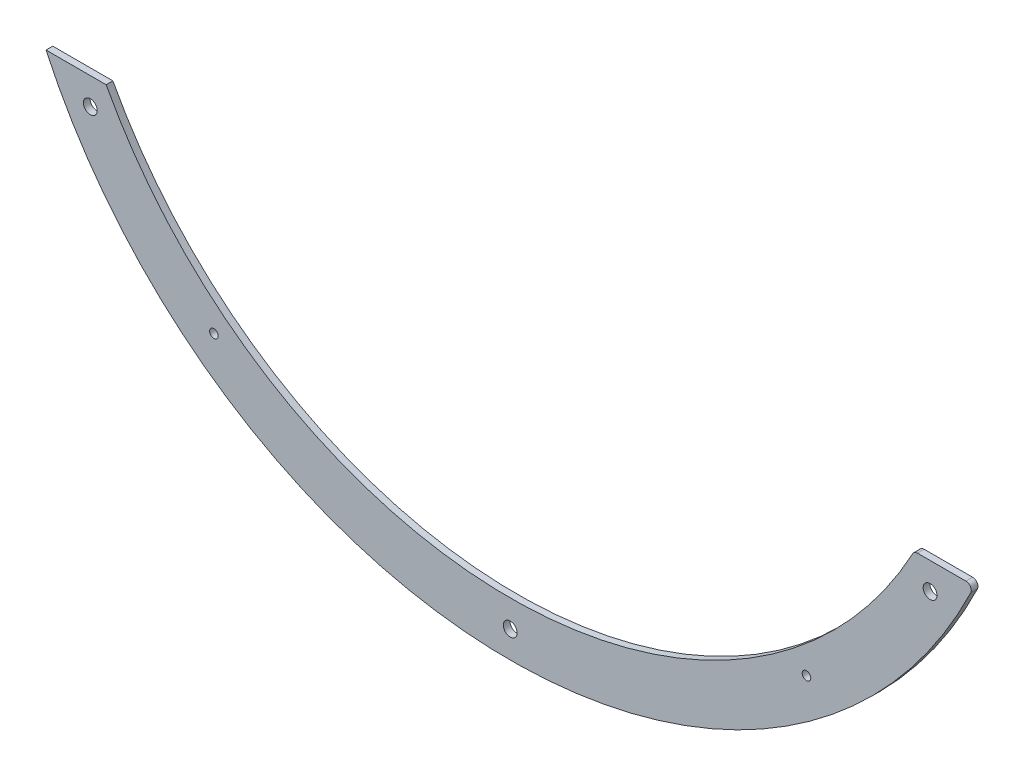
ISO-10303-21;
HEADER;
FILE_DESCRIPTION(('STEP AP214'),'2;1');
FILE_NAME('part.step','',(''),(''),'','','');
FILE_SCHEMA(('AUTOMOTIVE_DESIGN { 1 0 10303 214 1 1 1 1 }'));
ENDSEC;
DATA;
#1=APPLICATION_CONTEXT('core data for automotive mechanical design processes');
#2=APPLICATION_PROTOCOL_DEFINITION('international standard','automotive_design',2000,#1);
#3=PRODUCT_CONTEXT('',#1,'mechanical');
#4=PRODUCT('Part','Part','',(#3));
#5=PRODUCT_RELATED_PRODUCT_CATEGORY('part','',(#4));
#6=PRODUCT_DEFINITION_FORMATION('','',#4);
#7=PRODUCT_DEFINITION_CONTEXT('part definition',#1,'design');
#8=PRODUCT_DEFINITION('design','',#6,#7);
#9=PRODUCT_DEFINITION_SHAPE('','',#8);
#10=(LENGTH_UNIT() NAMED_UNIT(*) SI_UNIT(.MILLI.,.METRE.));
#11=(NAMED_UNIT(*) PLANE_ANGLE_UNIT() SI_UNIT($,.RADIAN.));
#12=(NAMED_UNIT(*) SI_UNIT($,.STERADIAN.) SOLID_ANGLE_UNIT());
#13=UNCERTAINTY_MEASURE_WITH_UNIT(LENGTH_MEASURE(1.E-05),#10,'distance_accuracy_value','');
#14=(GEOMETRIC_REPRESENTATION_CONTEXT(3) GLOBAL_UNCERTAINTY_ASSIGNED_CONTEXT((#13)) GLOBAL_UNIT_ASSIGNED_CONTEXT((#10,
#11,#12)) REPRESENTATION_CONTEXT('',''));
#15=CARTESIAN_POINT('',(0.,0.,0.));
#16=DIRECTION('',(0.,0.,1.));
#17=DIRECTION('',(1.,0.,0.));
#18=AXIS2_PLACEMENT_3D('',#15,#16,#17);
#19=CARTESIAN_POINT('',(0.,0.,3.175));
#20=DIRECTION('',(0.,0.,-1.));
#21=DIRECTION('',(-1.,0.,0.));
#22=AXIS2_PLACEMENT_3D('',#19,#20,#21);
#23=CYLINDRICAL_SURFACE('',#22,215.9);
#24=CARTESIAN_POINT('',(0.,0.,3.175));
#25=DIRECTION('',(0.,0.,1.));
#26=DIRECTION('',(1.,0.,0.));
#27=AXIS2_PLACEMENT_3D('',#24,#25,#26);
#28=CIRCLE('',#27,215.9);
#29=CARTESIAN_POINT('',(-190.5,-101.6,3.175));
#30=VERTEX_POINT('',#29);
#31=CARTESIAN_POINT('',(189.785185398674,-102.929069767442,3.175));
#32=VERTEX_POINT('',#31);
#33=EDGE_CURVE('E96',#30,#32,#28,.T.);
#34=ORIENTED_EDGE('',*,*,#33,.T.);
#35=DIRECTION('',(0.,0.,-1.));
#36=VECTOR('',#35,1.);
#37=CARTESIAN_POINT('',(189.785185398674,-102.929069767442,3.175));
#38=LINE('',#37,#36);
#39=CARTESIAN_POINT('',(189.785185398674,-102.929069767442,0.));
#40=VERTEX_POINT('',#39);
#41=EDGE_CURVE('E104',#32,#40,#38,.T.);
#42=ORIENTED_EDGE('',*,*,#41,.T.);
#43=CARTESIAN_POINT('',(0.,0.,0.));
#44=DIRECTION('',(0.,0.,1.));
#45=DIRECTION('',(1.,0.,0.));
#46=AXIS2_PLACEMENT_3D('',#43,#44,#45);
#47=CIRCLE('',#46,215.9);
#48=CARTESIAN_POINT('',(-190.5,-101.6,0.));
#49=VERTEX_POINT('',#48);
#50=EDGE_CURVE('E99',#49,#40,#47,.T.);
#51=ORIENTED_EDGE('',*,*,#50,.F.);
#52=DIRECTION('',(0.,0.,-1.));
#53=VECTOR('',#52,1.);
#54=CARTESIAN_POINT('',(-190.5,-101.6,3.175));
#55=LINE('',#54,#53);
#56=EDGE_CURVE('E93',#30,#49,#55,.T.);
#57=ORIENTED_EDGE('',*,*,#56,.F.);
#58=EDGE_LOOP('',(#34,#42,#51,#57));
#59=FACE_BOUND('',#58,.T.);
#60=ADVANCED_FACE('F39',(#59),#23,.F.);
#61=CARTESIAN_POINT('',(0.,-101.6,3.175));
#62=DIRECTION('',(0.,1.,0.));
#63=DIRECTION('',(0.,0.,1.));
#64=AXIS2_PLACEMENT_3D('',#61,#62,#63);
#65=PLANE('',#64);
#66=DIRECTION('',(1.,0.,0.));
#67=VECTOR('',#66,1.);
#68=CARTESIAN_POINT('',(0.,-101.6,0.));
#69=LINE('',#68,#67);
#70=CARTESIAN_POINT('',(-218.867836833099,-101.6,0.));
#71=VERTEX_POINT('',#70);
#72=EDGE_CURVE('E141',#71,#49,#69,.T.);
#73=ORIENTED_EDGE('',*,*,#72,.F.);
#74=DIRECTION('',(0.,0.,-1.));
#75=VECTOR('',#74,1.);
#76=CARTESIAN_POINT('',(-218.867836833099,-101.6,3.175));
#77=LINE('',#76,#75);
#78=CARTESIAN_POINT('',(-218.867836833099,-101.6,3.175));
#79=VERTEX_POINT('',#78);
#80=EDGE_CURVE('E105',#79,#71,#77,.T.);
#81=ORIENTED_EDGE('',*,*,#80,.F.);
#82=DIRECTION('',(1.,0.,0.));
#83=VECTOR('',#82,1.);
#84=CARTESIAN_POINT('',(0.,-101.6,3.175));
#85=LINE('',#84,#83);
#86=EDGE_CURVE('E110',#79,#30,#85,.T.);
#87=ORIENTED_EDGE('',*,*,#86,.T.);
#88=ORIENTED_EDGE('',*,*,#56,.T.);
#89=EDGE_LOOP('',(#73,#81,#87,#88));
#90=FACE_BOUND('',#89,.T.);
#91=ADVANCED_FACE('F114',(#90),#65,.T.);
#92=CARTESIAN_POINT('',(0.,0.,3.175));
#93=DIRECTION('',(0.,0.,-1.));
#94=DIRECTION('',(-1.,0.,0.));
#95=AXIS2_PLACEMENT_3D('',#92,#93,#94);
#96=CYLINDRICAL_SURFACE('',#95,241.3);
#97=CARTESIAN_POINT('',(0.,0.,0.));
#98=DIRECTION('',(0.,0.,1.));
#99=DIRECTION('',(1.,0.,0.));
#100=AXIS2_PLACEMENT_3D('',#97,#98,#99);
#101=CIRCLE('',#100,241.3);
#102=CARTESIAN_POINT('',(217.137227042747,-105.247872340426,0.));
#103=VERTEX_POINT('',#102);
#104=EDGE_CURVE('E143',#71,#103,#101,.T.);
#105=ORIENTED_EDGE('',*,*,#104,.T.);
#106=DIRECTION('',(0.,0.,-1.));
#107=VECTOR('',#106,1.);
#108=CARTESIAN_POINT('',(217.137227042747,-105.247872340426,3.175));
#109=LINE('',#108,#107);
#110=CARTESIAN_POINT('',(217.137227042747,-105.247872340426,3.175));
#111=VERTEX_POINT('',#110);
#112=EDGE_CURVE('E11',#103,#111,#109,.F.);
#113=ORIENTED_EDGE('',*,*,#112,.T.);
#114=CARTESIAN_POINT('',(0.,0.,3.175));
#115=DIRECTION('',(0.,0.,1.));
#116=DIRECTION('',(1.,0.,0.));
#117=AXIS2_PLACEMENT_3D('',#114,#115,#116);
#118=CIRCLE('',#117,241.3);
#119=EDGE_CURVE('E115',#79,#111,#118,.T.);
#120=ORIENTED_EDGE('',*,*,#119,.F.);
#121=ORIENTED_EDGE('',*,*,#80,.T.);
#122=EDGE_LOOP('',(#105,#113,#120,#121));
#123=FACE_BOUND('',#122,.T.);
#124=ADVANCED_FACE('F180',(#123),#96,.T.);
#125=CARTESIAN_POINT('',(-139.7,-177.8,3.175));
#126=DIRECTION('',(0.,0.,-1.));
#127=DIRECTION('',(-1.,0.,0.));
#128=AXIS2_PLACEMENT_3D('',#125,#126,#127);
#129=CYLINDRICAL_SURFACE('',#128,2.0193);
#130=CARTESIAN_POINT('',(-139.7,-177.8,3.175));
#131=DIRECTION('',(0.,0.,1.));
#132=DIRECTION('',(1.,0.,0.));
#133=AXIS2_PLACEMENT_3D('',#130,#131,#132);
#134=CIRCLE('',#133,2.0193);
#135=CARTESIAN_POINT('',(-137.6807,-177.8,3.175));
#136=VERTEX_POINT('',#135);
#137=EDGE_CURVE('E134',#136,#136,#134,.T.);
#138=ORIENTED_EDGE('',*,*,#137,.T.);
#139=EDGE_LOOP('',(#138));
#140=FACE_BOUND('',#139,.T.);
#141=CARTESIAN_POINT('',(-139.7,-177.8,0.));
#142=DIRECTION('',(0.,0.,1.));
#143=DIRECTION('',(1.,0.,0.));
#144=AXIS2_PLACEMENT_3D('',#141,#142,#143);
#145=CIRCLE('',#144,2.0193);
#146=CARTESIAN_POINT('',(-137.6807,-177.8,0.));
#147=VERTEX_POINT('',#146);
#148=EDGE_CURVE('E155',#147,#147,#145,.T.);
#149=ORIENTED_EDGE('',*,*,#148,.F.);
#150=EDGE_LOOP('',(#149));
#151=FACE_BOUND('',#150,.T.);
#152=ADVANCED_FACE('F194',(#140,#151),#129,.F.);
#153=CARTESIAN_POINT('',(197.973407305121,-114.300000000002,3.175));
#154=DIRECTION('',(0.,0.,-1.));
#155=DIRECTION('',(-1.,0.,0.));
#156=AXIS2_PLACEMENT_3D('',#153,#154,#155);
#157=CYLINDRICAL_SURFACE('',#156,3.2639);
#158=CARTESIAN_POINT('',(197.973407305121,-114.300000000002,3.175));
#159=DIRECTION('',(0.,0.,1.));
#160=DIRECTION('',(1.,0.,0.));
#161=AXIS2_PLACEMENT_3D('',#158,#159,#160);
#162=CIRCLE('',#161,3.2639);
#163=CARTESIAN_POINT('',(201.237307305121,-114.300000000002,3.175));
#164=VERTEX_POINT('',#163);
#165=EDGE_CURVE('E129',#164,#164,#162,.T.);
#166=ORIENTED_EDGE('',*,*,#165,.T.);
#167=EDGE_LOOP('',(#166));
#168=FACE_BOUND('',#167,.T.);
#169=CARTESIAN_POINT('',(197.973407305121,-114.300000000002,0.));
#170=DIRECTION('',(0.,0.,1.));
#171=DIRECTION('',(1.,0.,0.));
#172=AXIS2_PLACEMENT_3D('',#169,#170,#171);
#173=CIRCLE('',#172,3.2639);
#174=CARTESIAN_POINT('',(201.237307305121,-114.300000000002,0.));
#175=VERTEX_POINT('',#174);
#176=EDGE_CURVE('E152',#175,#175,#173,.T.);
#177=ORIENTED_EDGE('',*,*,#176,.F.);
#178=EDGE_LOOP('',(#177));
#179=FACE_BOUND('',#178,.T.);
#180=ADVANCED_FACE('F204',(#168,#179),#157,.F.);
#181=CARTESIAN_POINT('',(-197.973407305123,-114.3,3.175));
#182=DIRECTION('',(0.,0.,-1.));
#183=DIRECTION('',(-1.,0.,0.));
#184=AXIS2_PLACEMENT_3D('',#181,#182,#183);
#185=CYLINDRICAL_SURFACE('',#184,3.26390000000003);
#186=CARTESIAN_POINT('',(-197.973407305123,-114.3,3.175));
#187=DIRECTION('',(0.,0.,1.));
#188=DIRECTION('',(1.,0.,0.));
#189=AXIS2_PLACEMENT_3D('',#186,#187,#188);
#190=CIRCLE('',#189,3.26390000000003);
#191=CARTESIAN_POINT('',(-194.709507305123,-114.3,3.175));
#192=VERTEX_POINT('',#191);
#193=EDGE_CURVE('E124',#192,#192,#190,.T.);
#194=ORIENTED_EDGE('',*,*,#193,.T.);
#195=EDGE_LOOP('',(#194));
#196=FACE_BOUND('',#195,.T.);
#197=CARTESIAN_POINT('',(-197.973407305123,-114.3,0.));
#198=DIRECTION('',(0.,0.,1.));
#199=DIRECTION('',(1.,0.,0.));
#200=AXIS2_PLACEMENT_3D('',#197,#198,#199);
#201=CIRCLE('',#200,3.26390000000003);
#202=CARTESIAN_POINT('',(-194.709507305123,-114.3,0.));
#203=VERTEX_POINT('',#202);
#204=EDGE_CURVE('E149',#203,#203,#201,.T.);
#205=ORIENTED_EDGE('',*,*,#204,.F.);
#206=EDGE_LOOP('',(#205));
#207=FACE_BOUND('',#206,.T.);
#208=ADVANCED_FACE('F201',(#196,#207),#185,.F.);
#209=CARTESIAN_POINT('',(0.,-228.6,3.175));
#210=DIRECTION('',(0.,0.,-1.));
#211=DIRECTION('',(-1.,0.,0.));
#212=AXIS2_PLACEMENT_3D('',#209,#210,#211);
#213=CYLINDRICAL_SURFACE('',#212,3.2639);
#214=CARTESIAN_POINT('',(0.,-228.6,3.175));
#215=DIRECTION('',(0.,0.,1.));
#216=DIRECTION('',(1.,0.,0.));
#217=AXIS2_PLACEMENT_3D('',#214,#215,#216);
#218=CIRCLE('',#217,3.2639);
#219=CARTESIAN_POINT('',(3.2639,-228.6,3.175));
#220=VERTEX_POINT('',#219);
#221=EDGE_CURVE('E119',#220,#220,#218,.T.);
#222=ORIENTED_EDGE('',*,*,#221,.T.);
#223=EDGE_LOOP('',(#222));
#224=FACE_BOUND('',#223,.T.);
#225=CARTESIAN_POINT('',(0.,-228.6,0.));
#226=DIRECTION('',(0.,0.,1.));
#227=DIRECTION('',(1.,0.,0.));
#228=AXIS2_PLACEMENT_3D('',#225,#226,#227);
#229=CIRCLE('',#228,3.2639);
#230=CARTESIAN_POINT('',(3.2639,-228.6,0.));
#231=VERTEX_POINT('',#230);
#232=EDGE_CURVE('E146',#231,#231,#229,.T.);
#233=ORIENTED_EDGE('',*,*,#232,.F.);
#234=EDGE_LOOP('',(#233));
#235=FACE_BOUND('',#234,.T.);
#236=ADVANCED_FACE('F198',(#224,#235),#213,.F.);
#237=CARTESIAN_POINT('',(192.017952285717,-101.6,0.));
#238=VERTEX_POINT('',#237);
#239=CARTESIAN_POINT('',(214.851572021244,-101.6,0.));
#240=VERTEX_POINT('',#239);
#241=EDGE_CURVE('E144',#238,#240,#69,.T.);
#242=ORIENTED_EDGE('',*,*,#241,.F.);
#243=DIRECTION('',(0.,0.,-1.));
#244=VECTOR('',#243,1.);
#245=CARTESIAN_POINT('',(192.017952285717,-101.6,3.175));
#246=LINE('',#245,#244);
#247=CARTESIAN_POINT('',(192.017952285717,-101.6,3.175));
#248=VERTEX_POINT('',#247);
#249=EDGE_CURVE('E168',#238,#248,#246,.F.);
#250=ORIENTED_EDGE('',*,*,#249,.T.);
#251=CARTESIAN_POINT('',(214.851572021244,-101.6,3.175));
#252=VERTEX_POINT('',#251);
#253=EDGE_CURVE('E117',#248,#252,#85,.T.);
#254=ORIENTED_EDGE('',*,*,#253,.T.);
#255=DIRECTION('',(0.,0.,1.));
#256=VECTOR('',#255,1.);
#257=CARTESIAN_POINT('',(214.851572021244,-101.6,0.));
#258=LINE('',#257,#256);
#259=EDGE_CURVE('E166',#252,#240,#258,.F.);
#260=ORIENTED_EDGE('',*,*,#259,.T.);
#261=EDGE_LOOP('',(#242,#250,#254,#260));
#262=FACE_BOUND('',#261,.T.);
#263=ADVANCED_FACE('F172',(#262),#65,.T.);
#264=CARTESIAN_POINT('',(139.7,-177.8,3.175));
#265=DIRECTION('',(0.,0.,-1.));
#266=DIRECTION('',(-1.,0.,0.));
#267=AXIS2_PLACEMENT_3D('',#264,#265,#266);
#268=CYLINDRICAL_SURFACE('',#267,2.0193);
#269=CARTESIAN_POINT('',(139.7,-177.8,3.175));
#270=DIRECTION('',(0.,0.,1.));
#271=DIRECTION('',(1.,0.,0.));
#272=AXIS2_PLACEMENT_3D('',#269,#270,#271);
#273=CIRCLE('',#272,2.0193);
#274=CARTESIAN_POINT('',(141.7193,-177.8,3.175));
#275=VERTEX_POINT('',#274);
#276=EDGE_CURVE('E137',#275,#275,#273,.F.);
#277=ORIENTED_EDGE('',*,*,#276,.F.);
#278=EDGE_LOOP('',(#277));
#279=FACE_BOUND('',#278,.T.);
#280=CARTESIAN_POINT('',(139.7,-177.8,0.));
#281=DIRECTION('',(0.,0.,1.));
#282=DIRECTION('',(1.,0.,0.));
#283=AXIS2_PLACEMENT_3D('',#280,#281,#282);
#284=CIRCLE('',#283,2.0193);
#285=CARTESIAN_POINT('',(141.7193,-177.8,0.));
#286=VERTEX_POINT('',#285);
#287=EDGE_CURVE('E112',#286,#286,#284,.F.);
#288=ORIENTED_EDGE('',*,*,#287,.T.);
#289=EDGE_LOOP('',(#288));
#290=FACE_BOUND('',#289,.T.);
#291=ADVANCED_FACE('F197',(#279,#290),#268,.F.);
#292=CARTESIAN_POINT('',(0.,0.,3.175));
#293=DIRECTION('',(0.,0.,1.));
#294=DIRECTION('',(1.,0.,0.));
#295=AXIS2_PLACEMENT_3D('',#292,#293,#294);
#296=PLANE('',#295);
#297=ORIENTED_EDGE('',*,*,#253,.F.);
#298=CARTESIAN_POINT('',(192.017952285717,-104.14,3.175));
#299=DIRECTION('',(0.,0.,1.));
#300=DIRECTION('',(1.,0.,0.));
#301=AXIS2_PLACEMENT_3D('',#298,#299,#300);
#302=CIRCLE('',#301,2.54);
#303=EDGE_CURVE('E47',#248,#32,#302,.T.);
#304=ORIENTED_EDGE('',*,*,#303,.T.);
#305=ORIENTED_EDGE('',*,*,#33,.F.);
#306=ORIENTED_EDGE('',*,*,#86,.F.);
#307=ORIENTED_EDGE('',*,*,#119,.T.);
#308=CARTESIAN_POINT('',(214.851572021244,-104.14,3.175));
#309=DIRECTION('',(0.,0.,1.));
#310=DIRECTION('',(1.,0.,0.));
#311=AXIS2_PLACEMENT_3D('',#308,#309,#310);
#312=CIRCLE('',#311,2.54);
#313=EDGE_CURVE('E59',#111,#252,#312,.T.);
#314=ORIENTED_EDGE('',*,*,#313,.T.);
#315=EDGE_LOOP('',(#297,#304,#305,#306,#307,#314));
#316=FACE_BOUND('',#315,.T.);
#317=ORIENTED_EDGE('',*,*,#221,.F.);
#318=EDGE_LOOP('',(#317));
#319=FACE_BOUND('',#318,.T.);
#320=ORIENTED_EDGE('',*,*,#193,.F.);
#321=EDGE_LOOP('',(#320));
#322=FACE_BOUND('',#321,.T.);
#323=ORIENTED_EDGE('',*,*,#165,.F.);
#324=EDGE_LOOP('',(#323));
#325=FACE_BOUND('',#324,.T.);
#326=ORIENTED_EDGE('',*,*,#137,.F.);
#327=EDGE_LOOP('',(#326));
#328=FACE_BOUND('',#327,.T.);
#329=ORIENTED_EDGE('',*,*,#276,.T.);
#330=EDGE_LOOP('',(#329));
#331=FACE_BOUND('',#330,.T.);
#332=ADVANCED_FACE('F108',(#316,#319,#322,#325,#328,#331),#296,.T.);
#333=CARTESIAN_POINT('',(0.,0.,0.));
#334=DIRECTION('',(0.,0.,1.));
#335=DIRECTION('',(1.,0.,0.));
#336=AXIS2_PLACEMENT_3D('',#333,#334,#335);
#337=PLANE('',#336);
#338=ORIENTED_EDGE('',*,*,#50,.T.);
#339=CARTESIAN_POINT('',(192.017952285717,-104.14,0.));
#340=DIRECTION('',(0.,0.,1.));
#341=DIRECTION('',(1.,0.,0.));
#342=AXIS2_PLACEMENT_3D('',#339,#340,#341);
#343=CIRCLE('',#342,2.54);
#344=EDGE_CURVE('E164',#40,#238,#343,.F.);
#345=ORIENTED_EDGE('',*,*,#344,.T.);
#346=ORIENTED_EDGE('',*,*,#241,.T.);
#347=CARTESIAN_POINT('',(214.851572021244,-104.14,0.));
#348=DIRECTION('',(0.,0.,1.));
#349=DIRECTION('',(1.,0.,0.));
#350=AXIS2_PLACEMENT_3D('',#347,#348,#349);
#351=CIRCLE('',#350,2.54);
#352=EDGE_CURVE('E162',#240,#103,#351,.F.);
#353=ORIENTED_EDGE('',*,*,#352,.T.);
#354=ORIENTED_EDGE('',*,*,#104,.F.);
#355=ORIENTED_EDGE('',*,*,#72,.T.);
#356=EDGE_LOOP('',(#338,#345,#346,#353,#354,#355));
#357=FACE_BOUND('',#356,.T.);
#358=ORIENTED_EDGE('',*,*,#232,.T.);
#359=EDGE_LOOP('',(#358));
#360=FACE_BOUND('',#359,.T.);
#361=ORIENTED_EDGE('',*,*,#204,.T.);
#362=EDGE_LOOP('',(#361));
#363=FACE_BOUND('',#362,.T.);
#364=ORIENTED_EDGE('',*,*,#176,.T.);
#365=EDGE_LOOP('',(#364));
#366=FACE_BOUND('',#365,.T.);
#367=ORIENTED_EDGE('',*,*,#148,.T.);
#368=EDGE_LOOP('',(#367));
#369=FACE_BOUND('',#368,.T.);
#370=ORIENTED_EDGE('',*,*,#287,.F.);
#371=EDGE_LOOP('',(#370));
#372=FACE_BOUND('',#371,.T.);
#373=ADVANCED_FACE('F177',(#357,#360,#363,#366,#369,#372),#337,.F.);
#374=CARTESIAN_POINT('',(192.017952285717,-104.14,3.175));
#375=DIRECTION('',(0.,0.,-1.));
#376=DIRECTION('',(-1.,0.,0.));
#377=AXIS2_PLACEMENT_3D('',#374,#375,#376);
#378=CYLINDRICAL_SURFACE('',#377,2.54);
#379=ORIENTED_EDGE('',*,*,#303,.F.);
#380=ORIENTED_EDGE('',*,*,#249,.F.);
#381=ORIENTED_EDGE('',*,*,#344,.F.);
#382=ORIENTED_EDGE('',*,*,#41,.F.);
#383=EDGE_LOOP('',(#379,#380,#381,#382));
#384=FACE_BOUND('',#383,.T.);
#385=ADVANCED_FACE('F175',(#384),#378,.T.);
#386=CARTESIAN_POINT('',(214.851572021244,-104.14,3.175));
#387=DIRECTION('',(0.,0.,-1.));
#388=DIRECTION('',(-1.,0.,0.));
#389=AXIS2_PLACEMENT_3D('',#386,#387,#388);
#390=CYLINDRICAL_SURFACE('',#389,2.54);
#391=ORIENTED_EDGE('',*,*,#313,.F.);
#392=ORIENTED_EDGE('',*,*,#112,.F.);
#393=ORIENTED_EDGE('',*,*,#352,.F.);
#394=ORIENTED_EDGE('',*,*,#259,.F.);
#395=EDGE_LOOP('',(#391,#392,#393,#394));
#396=FACE_BOUND('',#395,.T.);
#397=ADVANCED_FACE('F41',(#396),#390,.T.);
#398=CLOSED_SHELL('',(#60,#91,#124,#152,#180,#208,#236,#263,#291,#332,#373,#385,#397));
#399=MANIFOLD_SOLID_BREP('B2',#398);
#400=ADVANCED_BREP_SHAPE_REPRESENTATION('',(#18,#399),#14);
#401=SHAPE_DEFINITION_REPRESENTATION(#9,#400);
ENDSEC;
END-ISO-10303-21;
